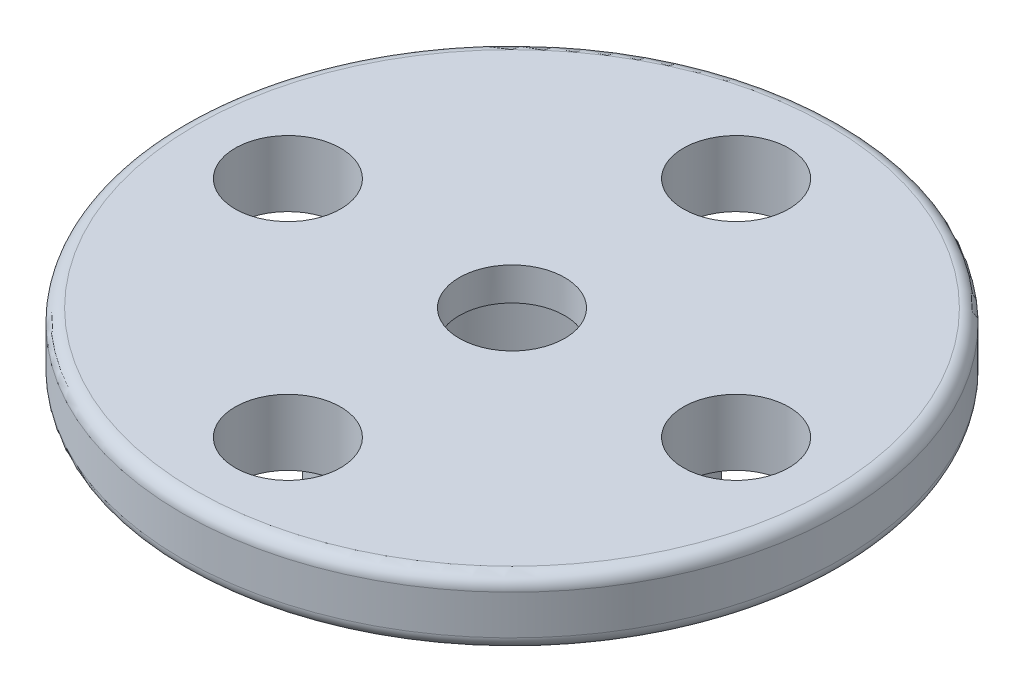
ISO-10303-21;
HEADER;
FILE_DESCRIPTION(('STEP AP214'),'2;1');
FILE_NAME('part.step','',(''),(''),'','','');
FILE_SCHEMA(('AUTOMOTIVE_DESIGN { 1 0 10303 214 1 1 1 1 }'));
ENDSEC;
DATA;
#1=APPLICATION_CONTEXT('core data for automotive mechanical design processes');
#2=APPLICATION_PROTOCOL_DEFINITION('international standard','automotive_design',2000,#1);
#3=PRODUCT_CONTEXT('',#1,'mechanical');
#4=PRODUCT('Part','Part','',(#3));
#5=PRODUCT_RELATED_PRODUCT_CATEGORY('part','',(#4));
#6=PRODUCT_DEFINITION_FORMATION('','',#4);
#7=PRODUCT_DEFINITION_CONTEXT('part definition',#1,'design');
#8=PRODUCT_DEFINITION('design','',#6,#7);
#9=PRODUCT_DEFINITION_SHAPE('','',#8);
#10=(LENGTH_UNIT() NAMED_UNIT(*) SI_UNIT(.MILLI.,.METRE.));
#11=(NAMED_UNIT(*) PLANE_ANGLE_UNIT() SI_UNIT($,.RADIAN.));
#12=(NAMED_UNIT(*) SI_UNIT($,.STERADIAN.) SOLID_ANGLE_UNIT());
#13=UNCERTAINTY_MEASURE_WITH_UNIT(LENGTH_MEASURE(1.E-05),#10,'distance_accuracy_value','');
#14=(GEOMETRIC_REPRESENTATION_CONTEXT(3) GLOBAL_UNCERTAINTY_ASSIGNED_CONTEXT((#13)) GLOBAL_UNIT_ASSIGNED_CONTEXT((#10,
#11,#12)) REPRESENTATION_CONTEXT('',''));
#15=CARTESIAN_POINT('',(0.,0.,0.));
#16=DIRECTION('',(0.,0.,1.));
#17=DIRECTION('',(1.,0.,0.));
#18=AXIS2_PLACEMENT_3D('',#15,#16,#17);
#19=CARTESIAN_POINT('',(0.,0.,0.));
#20=DIRECTION('',(0.,1.,0.));
#21=DIRECTION('',(0.,0.,1.));
#22=AXIS2_PLACEMENT_3D('',#19,#20,#21);
#23=CYLINDRICAL_SURFACE('',#22,1.6);
#24=CARTESIAN_POINT('',(0.,2.,0.));
#25=DIRECTION('',(0.,1.,0.));
#26=DIRECTION('',(0.,0.,1.));
#27=AXIS2_PLACEMENT_3D('',#24,#25,#26);
#28=CIRCLE('',#27,1.6);
#29=CARTESIAN_POINT('',(0.,2.,1.6));
#30=VERTEX_POINT('',#29);
#31=EDGE_CURVE('E64',#30,#30,#28,.T.);
#32=ORIENTED_EDGE('',*,*,#31,.T.);
#33=EDGE_LOOP('',(#32));
#34=FACE_BOUND('',#33,.T.);
#35=CARTESIAN_POINT('',(0.,1.,0.));
#36=DIRECTION('',(0.,-1.,0.));
#37=DIRECTION('',(0.,0.,-1.));
#38=AXIS2_PLACEMENT_3D('',#35,#36,#37);
#39=CIRCLE('',#38,1.6);
#40=CARTESIAN_POINT('',(0.,1.,-1.6));
#41=VERTEX_POINT('',#40);
#42=EDGE_CURVE('E49',#41,#41,#39,.F.);
#43=ORIENTED_EDGE('',*,*,#42,.F.);
#44=EDGE_LOOP('',(#43));
#45=FACE_BOUND('',#44,.T.);
#46=ADVANCED_FACE('F31',(#34,#45),#23,.F.);
#47=CARTESIAN_POINT('',(0.,0.5,0.));
#48=DIRECTION('',(0.,-1.,0.));
#49=DIRECTION('',(0.,0.,-1.));
#50=AXIS2_PLACEMENT_3D('',#47,#48,#49);
#51=CYLINDRICAL_SURFACE('',#50,10.);
#52=CARTESIAN_POINT('',(0.,0.4,0.));
#53=DIRECTION('',(0.,1.,0.));
#54=DIRECTION('',(0.,0.,1.));
#55=AXIS2_PLACEMENT_3D('',#52,#53,#54);
#56=CIRCLE('',#55,10.);
#57=CARTESIAN_POINT('',(0.,0.4,10.));
#58=VERTEX_POINT('',#57);
#59=EDGE_CURVE('E58',#58,#58,#56,.T.);
#60=ORIENTED_EDGE('',*,*,#59,.T.);
#61=EDGE_LOOP('',(#60));
#62=FACE_BOUND('',#61,.T.);
#63=CARTESIAN_POINT('',(0.,1.6,0.));
#64=DIRECTION('',(0.,1.,0.));
#65=DIRECTION('',(0.,0.,1.));
#66=AXIS2_PLACEMENT_3D('',#63,#64,#65);
#67=CIRCLE('',#66,10.);
#68=CARTESIAN_POINT('',(0.,1.6,10.));
#69=VERTEX_POINT('',#68);
#70=EDGE_CURVE('E61',#69,#69,#67,.F.);
#71=ORIENTED_EDGE('',*,*,#70,.T.);
#72=EDGE_LOOP('',(#71));
#73=FACE_BOUND('',#72,.T.);
#74=ADVANCED_FACE('F115',(#62,#73),#51,.T.);
#75=CARTESIAN_POINT('',(0.,0.,0.));
#76=DIRECTION('',(0.,1.,0.));
#77=DIRECTION('',(0.,0.,1.));
#78=AXIS2_PLACEMENT_3D('',#75,#76,#77);
#79=PLANE('',#78);
#80=CARTESIAN_POINT('',(0.,0.,0.));
#81=DIRECTION('',(0.,1.,0.));
#82=DIRECTION('',(0.,0.,1.));
#83=AXIS2_PLACEMENT_3D('',#80,#81,#82);
#84=CIRCLE('',#83,4.5);
#85=CARTESIAN_POINT('',(0.,0.,4.5));
#86=VERTEX_POINT('',#85);
#87=EDGE_CURVE('E42',#86,#86,#84,.F.);
#88=ORIENTED_EDGE('',*,*,#87,.F.);
#89=EDGE_LOOP('',(#88));
#90=FACE_BOUND('',#89,.T.);
#91=CARTESIAN_POINT('',(0.,0.,0.));
#92=DIRECTION('',(0.,1.,0.));
#93=DIRECTION('',(0.,0.,1.));
#94=AXIS2_PLACEMENT_3D('',#91,#92,#93);
#95=CIRCLE('',#94,9.6);
#96=CARTESIAN_POINT('',(0.,0.,9.6));
#97=VERTEX_POINT('',#96);
#98=EDGE_CURVE('E55',#97,#97,#95,.F.);
#99=ORIENTED_EDGE('',*,*,#98,.T.);
#100=EDGE_LOOP('',(#99));
#101=FACE_BOUND('',#100,.T.);
#102=CARTESIAN_POINT('',(-6.8,0.,0.));
#103=DIRECTION('',(0.,1.,0.));
#104=DIRECTION('',(0.,0.,1.));
#105=AXIS2_PLACEMENT_3D('',#102,#103,#104);
#106=CIRCLE('',#105,1.6);
#107=CARTESIAN_POINT('',(-6.8,0.,1.6));
#108=VERTEX_POINT('',#107);
#109=EDGE_CURVE('E67',#108,#108,#106,.T.);
#110=ORIENTED_EDGE('',*,*,#109,.T.);
#111=EDGE_LOOP('',(#110));
#112=FACE_BOUND('',#111,.T.);
#113=CARTESIAN_POINT('',(6.8,0.,0.));
#114=DIRECTION('',(0.,1.,0.));
#115=DIRECTION('',(0.,0.,1.));
#116=AXIS2_PLACEMENT_3D('',#113,#114,#115);
#117=CIRCLE('',#116,1.6);
#118=CARTESIAN_POINT('',(6.8,0.,1.6));
#119=VERTEX_POINT('',#118);
#120=EDGE_CURVE('E70',#119,#119,#117,.T.);
#121=ORIENTED_EDGE('',*,*,#120,.T.);
#122=EDGE_LOOP('',(#121));
#123=FACE_BOUND('',#122,.T.);
#124=CARTESIAN_POINT('',(0.,0.,-6.8));
#125=DIRECTION('',(0.,1.,0.));
#126=DIRECTION('',(0.,0.,1.));
#127=AXIS2_PLACEMENT_3D('',#124,#125,#126);
#128=CIRCLE('',#127,1.6);
#129=CARTESIAN_POINT('',(0.,0.,-5.2));
#130=VERTEX_POINT('',#129);
#131=EDGE_CURVE('E73',#130,#130,#128,.T.);
#132=ORIENTED_EDGE('',*,*,#131,.T.);
#133=EDGE_LOOP('',(#132));
#134=FACE_BOUND('',#133,.T.);
#135=CARTESIAN_POINT('',(0.,0.,6.8));
#136=DIRECTION('',(0.,1.,0.));
#137=DIRECTION('',(0.,0.,1.));
#138=AXIS2_PLACEMENT_3D('',#135,#136,#137);
#139=CIRCLE('',#138,1.6);
#140=CARTESIAN_POINT('',(0.,0.,8.4));
#141=VERTEX_POINT('',#140);
#142=EDGE_CURVE('E76',#141,#141,#139,.T.);
#143=ORIENTED_EDGE('',*,*,#142,.T.);
#144=EDGE_LOOP('',(#143));
#145=FACE_BOUND('',#144,.T.);
#146=ADVANCED_FACE('F121',(#90,#101,#112,#123,#134,#145),#79,.F.);
#147=CARTESIAN_POINT('',(0.,2.,0.));
#148=DIRECTION('',(0.,1.,0.));
#149=DIRECTION('',(0.,0.,1.));
#150=AXIS2_PLACEMENT_3D('',#147,#148,#149);
#151=PLANE('',#150);
#152=CARTESIAN_POINT('',(0.,2.,0.));
#153=DIRECTION('',(0.,1.,0.));
#154=DIRECTION('',(0.,0.,1.));
#155=AXIS2_PLACEMENT_3D('',#152,#153,#154);
#156=CIRCLE('',#155,9.6);
#157=CARTESIAN_POINT('',(0.,2.,9.6));
#158=VERTEX_POINT('',#157);
#159=EDGE_CURVE('E46',#158,#158,#156,.T.);
#160=ORIENTED_EDGE('',*,*,#159,.T.);
#161=EDGE_LOOP('',(#160));
#162=FACE_BOUND('',#161,.T.);
#163=CARTESIAN_POINT('',(-6.8,2.,0.));
#164=DIRECTION('',(0.,1.,0.));
#165=DIRECTION('',(0.,0.,1.));
#166=AXIS2_PLACEMENT_3D('',#163,#164,#165);
#167=CIRCLE('',#166,1.6);
#168=CARTESIAN_POINT('',(-6.8,2.,1.6));
#169=VERTEX_POINT('',#168);
#170=EDGE_CURVE('E79',#169,#169,#167,.T.);
#171=ORIENTED_EDGE('',*,*,#170,.F.);
#172=EDGE_LOOP('',(#171));
#173=FACE_BOUND('',#172,.T.);
#174=CARTESIAN_POINT('',(6.8,2.,0.));
#175=DIRECTION('',(0.,1.,0.));
#176=DIRECTION('',(0.,0.,1.));
#177=AXIS2_PLACEMENT_3D('',#174,#175,#176);
#178=CIRCLE('',#177,1.6);
#179=CARTESIAN_POINT('',(6.8,2.,1.6));
#180=VERTEX_POINT('',#179);
#181=EDGE_CURVE('E87',#180,#180,#178,.T.);
#182=ORIENTED_EDGE('',*,*,#181,.F.);
#183=EDGE_LOOP('',(#182));
#184=FACE_BOUND('',#183,.T.);
#185=CARTESIAN_POINT('',(0.,2.,-6.8));
#186=DIRECTION('',(0.,1.,0.));
#187=DIRECTION('',(0.,0.,1.));
#188=AXIS2_PLACEMENT_3D('',#185,#186,#187);
#189=CIRCLE('',#188,1.6);
#190=CARTESIAN_POINT('',(0.,2.,-5.2));
#191=VERTEX_POINT('',#190);
#192=EDGE_CURVE('E83',#191,#191,#189,.T.);
#193=ORIENTED_EDGE('',*,*,#192,.F.);
#194=EDGE_LOOP('',(#193));
#195=FACE_BOUND('',#194,.T.);
#196=CARTESIAN_POINT('',(0.,2.,6.8));
#197=DIRECTION('',(0.,1.,0.));
#198=DIRECTION('',(0.,0.,1.));
#199=AXIS2_PLACEMENT_3D('',#196,#197,#198);
#200=CIRCLE('',#199,1.6);
#201=CARTESIAN_POINT('',(0.,2.,8.4));
#202=VERTEX_POINT('',#201);
#203=EDGE_CURVE('E80',#202,#202,#200,.T.);
#204=ORIENTED_EDGE('',*,*,#203,.F.);
#205=EDGE_LOOP('',(#204));
#206=FACE_BOUND('',#205,.T.);
#207=ORIENTED_EDGE('',*,*,#31,.F.);
#208=EDGE_LOOP('',(#207));
#209=FACE_BOUND('',#208,.T.);
#210=ADVANCED_FACE('F129',(#162,#173,#184,#195,#206,#209),#151,.T.);
#211=CARTESIAN_POINT('',(0.,-8.,6.8));
#212=DIRECTION('',(0.,1.,0.));
#213=DIRECTION('',(0.,0.,1.));
#214=AXIS2_PLACEMENT_3D('',#211,#212,#213);
#215=CYLINDRICAL_SURFACE('',#214,1.6);
#216=ORIENTED_EDGE('',*,*,#203,.T.);
#217=EDGE_LOOP('',(#216));
#218=FACE_BOUND('',#217,.T.);
#219=ORIENTED_EDGE('',*,*,#142,.F.);
#220=EDGE_LOOP('',(#219));
#221=FACE_BOUND('',#220,.T.);
#222=ADVANCED_FACE('F127',(#218,#221),#215,.F.);
#223=CARTESIAN_POINT('',(0.,-8.,-6.8));
#224=DIRECTION('',(0.,1.,0.));
#225=DIRECTION('',(0.,0.,1.));
#226=AXIS2_PLACEMENT_3D('',#223,#224,#225);
#227=CYLINDRICAL_SURFACE('',#226,1.6);
#228=ORIENTED_EDGE('',*,*,#192,.T.);
#229=EDGE_LOOP('',(#228));
#230=FACE_BOUND('',#229,.T.);
#231=ORIENTED_EDGE('',*,*,#131,.F.);
#232=EDGE_LOOP('',(#231));
#233=FACE_BOUND('',#232,.T.);
#234=ADVANCED_FACE('F165',(#230,#233),#227,.F.);
#235=CARTESIAN_POINT('',(6.8,-8.,0.));
#236=DIRECTION('',(0.,1.,0.));
#237=DIRECTION('',(0.,0.,1.));
#238=AXIS2_PLACEMENT_3D('',#235,#236,#237);
#239=CYLINDRICAL_SURFACE('',#238,1.6);
#240=ORIENTED_EDGE('',*,*,#181,.T.);
#241=EDGE_LOOP('',(#240));
#242=FACE_BOUND('',#241,.T.);
#243=ORIENTED_EDGE('',*,*,#120,.F.);
#244=EDGE_LOOP('',(#243));
#245=FACE_BOUND('',#244,.T.);
#246=ADVANCED_FACE('F142',(#242,#245),#239,.F.);
#247=CARTESIAN_POINT('',(-6.8,-8.,0.));
#248=DIRECTION('',(0.,1.,0.));
#249=DIRECTION('',(0.,0.,1.));
#250=AXIS2_PLACEMENT_3D('',#247,#248,#249);
#251=CYLINDRICAL_SURFACE('',#250,1.6);
#252=ORIENTED_EDGE('',*,*,#170,.T.);
#253=EDGE_LOOP('',(#252));
#254=FACE_BOUND('',#253,.T.);
#255=ORIENTED_EDGE('',*,*,#109,.F.);
#256=EDGE_LOOP('',(#255));
#257=FACE_BOUND('',#256,.T.);
#258=ADVANCED_FACE('F137',(#254,#257),#251,.F.);
#259=CARTESIAN_POINT('',(0.,0.4,0.));
#260=DIRECTION('',(0.,1.,0.));
#261=DIRECTION('',(0.,0.,1.));
#262=AXIS2_PLACEMENT_3D('',#259,#260,#261);
#263=TOROIDAL_SURFACE('',#262,9.6,0.4);
#264=ORIENTED_EDGE('',*,*,#98,.F.);
#265=EDGE_LOOP('',(#264));
#266=FACE_BOUND('',#265,.T.);
#267=ORIENTED_EDGE('',*,*,#59,.F.);
#268=EDGE_LOOP('',(#267));
#269=FACE_BOUND('',#268,.T.);
#270=ADVANCED_FACE('F111',(#266,#269),#263,.T.);
#271=CARTESIAN_POINT('',(0.,1.6,0.));
#272=DIRECTION('',(0.,1.,0.));
#273=DIRECTION('',(0.,0.,1.));
#274=AXIS2_PLACEMENT_3D('',#271,#272,#273);
#275=TOROIDAL_SURFACE('',#274,9.6,0.4);
#276=ORIENTED_EDGE('',*,*,#70,.F.);
#277=EDGE_LOOP('',(#276));
#278=FACE_BOUND('',#277,.T.);
#279=ORIENTED_EDGE('',*,*,#159,.F.);
#280=EDGE_LOOP('',(#279));
#281=FACE_BOUND('',#280,.T.);
#282=ADVANCED_FACE('F102',(#278,#281),#275,.T.);
#283=CARTESIAN_POINT('',(0.,-3.,0.));
#284=DIRECTION('',(0.,-1.,0.));
#285=DIRECTION('',(0.,0.,-1.));
#286=AXIS2_PLACEMENT_3D('',#283,#284,#285);
#287=PLANE('',#286);
#288=CARTESIAN_POINT('',(0.,-3.,0.));
#289=DIRECTION('',(0.,-1.,0.));
#290=DIRECTION('',(0.,0.,-1.));
#291=AXIS2_PLACEMENT_3D('',#288,#289,#290);
#292=CIRCLE('',#291,4.5);
#293=CARTESIAN_POINT('',(0.,-3.,-4.5));
#294=VERTEX_POINT('',#293);
#295=EDGE_CURVE('E84',#294,#294,#292,.T.);
#296=ORIENTED_EDGE('',*,*,#295,.T.);
#297=EDGE_LOOP('',(#296));
#298=FACE_BOUND('',#297,.T.);
#299=CARTESIAN_POINT('',(0.,-3.,0.));
#300=DIRECTION('',(0.,-1.,0.));
#301=DIRECTION('',(0.,0.,-1.));
#302=AXIS2_PLACEMENT_3D('',#299,#300,#301);
#303=CIRCLE('',#302,3.5);
#304=CARTESIAN_POINT('',(0.,-3.,-3.5));
#305=VERTEX_POINT('',#304);
#306=EDGE_CURVE('E51',#305,#305,#303,.T.);
#307=ORIENTED_EDGE('',*,*,#306,.F.);
#308=EDGE_LOOP('',(#307));
#309=FACE_BOUND('',#308,.T.);
#310=ADVANCED_FACE('F99',(#298,#309),#287,.T.);
#311=CARTESIAN_POINT('',(0.,-3.,0.));
#312=DIRECTION('',(0.,1.,0.));
#313=DIRECTION('',(0.,0.,1.));
#314=AXIS2_PLACEMENT_3D('',#311,#312,#313);
#315=CYLINDRICAL_SURFACE('',#314,4.5);
#316=ORIENTED_EDGE('',*,*,#295,.F.);
#317=EDGE_LOOP('',(#316));
#318=FACE_BOUND('',#317,.T.);
#319=ORIENTED_EDGE('',*,*,#87,.T.);
#320=EDGE_LOOP('',(#319));
#321=FACE_BOUND('',#320,.T.);
#322=ADVANCED_FACE('F101',(#318,#321),#315,.T.);
#323=CARTESIAN_POINT('',(0.,-3.,0.));
#324=DIRECTION('',(0.,1.,0.));
#325=DIRECTION('',(0.,0.,1.));
#326=AXIS2_PLACEMENT_3D('',#323,#324,#325);
#327=CYLINDRICAL_SURFACE('',#326,3.5);
#328=CARTESIAN_POINT('',(0.,-0.2,0.));
#329=DIRECTION('',(0.,-1.,0.));
#330=DIRECTION('',(0.,0.,-1.));
#331=AXIS2_PLACEMENT_3D('',#328,#329,#330);
#332=CIRCLE('',#331,3.5);
#333=CARTESIAN_POINT('',(0.,-0.2,-3.5));
#334=VERTEX_POINT('',#333);
#335=EDGE_CURVE('E10',#334,#334,#332,.F.);
#336=ORIENTED_EDGE('',*,*,#335,.T.);
#337=EDGE_LOOP('',(#336));
#338=FACE_BOUND('',#337,.T.);
#339=ORIENTED_EDGE('',*,*,#306,.T.);
#340=EDGE_LOOP('',(#339));
#341=FACE_BOUND('',#340,.T.);
#342=ADVANCED_FACE('F97',(#338,#341),#327,.F.);
#343=CARTESIAN_POINT('',(0.,1.,0.));
#344=DIRECTION('',(0.,-1.,0.));
#345=DIRECTION('',(0.,0.,-1.));
#346=AXIS2_PLACEMENT_3D('',#343,#344,#345);
#347=PLANE('',#346);
#348=CARTESIAN_POINT('',(0.,1.,0.));
#349=DIRECTION('',(0.,-1.,0.));
#350=DIRECTION('',(0.,0.,-1.));
#351=AXIS2_PLACEMENT_3D('',#348,#349,#350);
#352=CIRCLE('',#351,2.3);
#353=CARTESIAN_POINT('',(0.,1.,-2.3));
#354=VERTEX_POINT('',#353);
#355=EDGE_CURVE('E38',#354,#354,#352,.T.);
#356=ORIENTED_EDGE('',*,*,#355,.T.);
#357=EDGE_LOOP('',(#356));
#358=FACE_BOUND('',#357,.T.);
#359=ORIENTED_EDGE('',*,*,#42,.T.);
#360=EDGE_LOOP('',(#359));
#361=FACE_BOUND('',#360,.T.);
#362=ADVANCED_FACE('F244',(#358,#361),#347,.T.);
#363=CARTESIAN_POINT('',(0.,-0.2,0.));
#364=DIRECTION('',(0.,-1.,0.));
#365=DIRECTION('',(0.,0.,-1.));
#366=AXIS2_PLACEMENT_3D('',#363,#364,#365);
#367=TOROIDAL_SURFACE('',#366,2.3,1.2);
#368=ORIENTED_EDGE('',*,*,#335,.F.);
#369=EDGE_LOOP('',(#368));
#370=FACE_BOUND('',#369,.T.);
#371=ORIENTED_EDGE('',*,*,#355,.F.);
#372=EDGE_LOOP('',(#371));
#373=FACE_BOUND('',#372,.T.);
#374=ADVANCED_FACE('F33',(#370,#373),#367,.F.);
#375=CLOSED_SHELL('',(#46,#74,#146,#210,#222,#234,#246,#258,#270,#282,#310,#322,#342,#362,#374));
#376=MANIFOLD_SOLID_BREP('B2',#375);
#377=ADVANCED_BREP_SHAPE_REPRESENTATION('',(#18,#376),#14);
#378=SHAPE_DEFINITION_REPRESENTATION(#9,#377);
ENDSEC;
END-ISO-10303-21;
